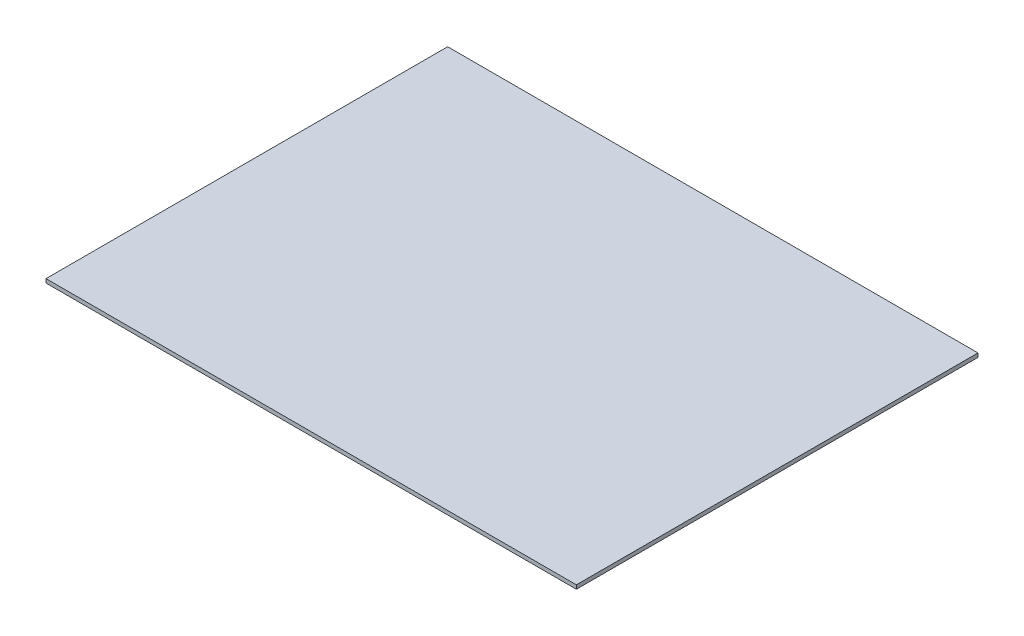
ISO-10303-21;
HEADER;
FILE_DESCRIPTION(('STEP AP214'),'2;1');
FILE_NAME('part.step','',(''),(''),'','','');
FILE_SCHEMA(('AUTOMOTIVE_DESIGN { 1 0 10303 214 1 1 1 1 }'));
ENDSEC;
DATA;
#1=APPLICATION_CONTEXT('core data for automotive mechanical design processes');
#2=APPLICATION_PROTOCOL_DEFINITION('international standard','automotive_design',2000,#1);
#3=PRODUCT_CONTEXT('',#1,'mechanical');
#4=PRODUCT('Part','Part','',(#3));
#5=PRODUCT_RELATED_PRODUCT_CATEGORY('part','',(#4));
#6=PRODUCT_DEFINITION_FORMATION('','',#4);
#7=PRODUCT_DEFINITION_CONTEXT('part definition',#1,'design');
#8=PRODUCT_DEFINITION('design','',#6,#7);
#9=PRODUCT_DEFINITION_SHAPE('','',#8);
#10=(LENGTH_UNIT() NAMED_UNIT(*) SI_UNIT(.MILLI.,.METRE.));
#11=(NAMED_UNIT(*) PLANE_ANGLE_UNIT() SI_UNIT($,.RADIAN.));
#12=(NAMED_UNIT(*) SI_UNIT($,.STERADIAN.) SOLID_ANGLE_UNIT());
#13=UNCERTAINTY_MEASURE_WITH_UNIT(LENGTH_MEASURE(1.E-05),#10,'distance_accuracy_value','');
#14=(GEOMETRIC_REPRESENTATION_CONTEXT(3) GLOBAL_UNCERTAINTY_ASSIGNED_CONTEXT((#13)) GLOBAL_UNIT_ASSIGNED_CONTEXT((#10,
#11,#12)) REPRESENTATION_CONTEXT('',''));
#15=CARTESIAN_POINT('',(0.,0.,0.));
#16=DIRECTION('',(0.,0.,1.));
#17=DIRECTION('',(1.,0.,0.));
#18=AXIS2_PLACEMENT_3D('',#15,#16,#17);
#19=CARTESIAN_POINT('',(-46.0117511781062,3.,-160.757124998766));
#20=DIRECTION('',(0.,0.,1.));
#21=DIRECTION('',(1.,0.,0.));
#22=AXIS2_PLACEMENT_3D('',#19,#20,#21);
#23=PLANE('',#22);
#24=DIRECTION('',(-1.,0.,0.));
#25=VECTOR('',#24,1.);
#26=CARTESIAN_POINT('',(-46.0117511781062,0.,-160.757124998766));
#27=LINE('',#26,#25);
#28=CARTESIAN_POINT('',(365.988248821894,0.,-160.757124998766));
#29=VERTEX_POINT('',#28);
#30=CARTESIAN_POINT('',(-46.0117511781062,0.,-160.757124998766));
#31=VERTEX_POINT('',#30);
#32=EDGE_CURVE('E95',#29,#31,#27,.T.);
#33=ORIENTED_EDGE('',*,*,#32,.T.);
#34=DIRECTION('',(0.,-1.,0.));
#35=VECTOR('',#34,1.);
#36=CARTESIAN_POINT('',(-46.0117511781062,3.,-160.757124998766));
#37=LINE('',#36,#35);
#38=CARTESIAN_POINT('',(-46.0117511781062,3.,-160.757124998766));
#39=VERTEX_POINT('',#38);
#40=EDGE_CURVE('E11',#39,#31,#37,.T.);
#41=ORIENTED_EDGE('',*,*,#40,.F.);
#42=DIRECTION('',(-1.,0.,0.));
#43=VECTOR('',#42,1.);
#44=CARTESIAN_POINT('',(-46.0117511781062,3.,-160.757124998766));
#45=LINE('',#44,#43);
#46=CARTESIAN_POINT('',(365.988248821894,3.,-160.757124998766));
#47=VERTEX_POINT('',#46);
#48=EDGE_CURVE('E83',#47,#39,#45,.T.);
#49=ORIENTED_EDGE('',*,*,#48,.F.);
#50=DIRECTION('',(0.,-1.,0.));
#51=VECTOR('',#50,1.);
#52=CARTESIAN_POINT('',(365.988248821894,3.,-160.757124998766));
#53=LINE('',#52,#51);
#54=EDGE_CURVE('E91',#47,#29,#53,.T.);
#55=ORIENTED_EDGE('',*,*,#54,.T.);
#56=EDGE_LOOP('',(#33,#41,#49,#55));
#57=FACE_BOUND('',#56,.T.);
#58=ADVANCED_FACE('F32',(#57),#23,.F.);
#59=CARTESIAN_POINT('',(-46.0117511781062,3.,-160.757124998766));
#60=DIRECTION('',(1.,0.,0.));
#61=DIRECTION('',(0.,0.,-1.));
#62=AXIS2_PLACEMENT_3D('',#59,#60,#61);
#63=PLANE('',#62);
#64=DIRECTION('',(0.,0.,1.));
#65=VECTOR('',#64,1.);
#66=CARTESIAN_POINT('',(-46.0117511781062,0.,-160.757124998766));
#67=LINE('',#66,#65);
#68=CARTESIAN_POINT('',(-46.0117511781062,0.,151.242875001234));
#69=VERTEX_POINT('',#68);
#70=EDGE_CURVE('E87',#31,#69,#67,.T.);
#71=ORIENTED_EDGE('',*,*,#70,.T.);
#72=DIRECTION('',(0.,-1.,0.));
#73=VECTOR('',#72,1.);
#74=CARTESIAN_POINT('',(-46.0117511781062,3.,151.242875001234));
#75=LINE('',#74,#73);
#76=CARTESIAN_POINT('',(-46.0117511781062,3.,151.242875001234));
#77=VERTEX_POINT('',#76);
#78=EDGE_CURVE('E40',#77,#69,#75,.T.);
#79=ORIENTED_EDGE('',*,*,#78,.F.);
#80=DIRECTION('',(0.,0.,1.));
#81=VECTOR('',#80,1.);
#82=CARTESIAN_POINT('',(-46.0117511781062,3.,-160.757124998766));
#83=LINE('',#82,#81);
#84=EDGE_CURVE('E78',#39,#77,#83,.T.);
#85=ORIENTED_EDGE('',*,*,#84,.F.);
#86=ORIENTED_EDGE('',*,*,#40,.T.);
#87=EDGE_LOOP('',(#71,#79,#85,#86));
#88=FACE_BOUND('',#87,.T.);
#89=ADVANCED_FACE('F86',(#88),#63,.F.);
#90=CARTESIAN_POINT('',(-46.0117511781062,3.,151.242875001234));
#91=DIRECTION('',(0.,0.,-1.));
#92=DIRECTION('',(-1.,0.,0.));
#93=AXIS2_PLACEMENT_3D('',#90,#91,#92);
#94=PLANE('',#93);
#95=DIRECTION('',(1.,0.,0.));
#96=VECTOR('',#95,1.);
#97=CARTESIAN_POINT('',(-46.0117511781062,0.,151.242875001234));
#98=LINE('',#97,#96);
#99=CARTESIAN_POINT('',(365.988248821894,0.,151.242875001235));
#100=VERTEX_POINT('',#99);
#101=EDGE_CURVE('E65',#69,#100,#98,.T.);
#102=ORIENTED_EDGE('',*,*,#101,.T.);
#103=DIRECTION('',(0.,-1.,0.));
#104=VECTOR('',#103,1.);
#105=CARTESIAN_POINT('',(365.988248821894,3.,151.242875001235));
#106=LINE('',#105,#104);
#107=CARTESIAN_POINT('',(365.988248821894,3.,151.242875001235));
#108=VERTEX_POINT('',#107);
#109=EDGE_CURVE('E88',#108,#100,#106,.T.);
#110=ORIENTED_EDGE('',*,*,#109,.F.);
#111=DIRECTION('',(1.,0.,0.));
#112=VECTOR('',#111,1.);
#113=CARTESIAN_POINT('',(-46.0117511781062,3.,151.242875001234));
#114=LINE('',#113,#112);
#115=EDGE_CURVE('E81',#77,#108,#114,.T.);
#116=ORIENTED_EDGE('',*,*,#115,.F.);
#117=ORIENTED_EDGE('',*,*,#78,.T.);
#118=EDGE_LOOP('',(#102,#110,#116,#117));
#119=FACE_BOUND('',#118,.T.);
#120=ADVANCED_FACE('F89',(#119),#94,.F.);
#121=CARTESIAN_POINT('',(365.988248821894,3.,-160.757124998766));
#122=DIRECTION('',(-1.,0.,0.));
#123=DIRECTION('',(0.,0.,1.));
#124=AXIS2_PLACEMENT_3D('',#121,#122,#123);
#125=PLANE('',#124);
#126=DIRECTION('',(0.,0.,-1.));
#127=VECTOR('',#126,1.);
#128=CARTESIAN_POINT('',(365.988248821894,0.,-160.757124998766));
#129=LINE('',#128,#127);
#130=EDGE_CURVE('E71',#100,#29,#129,.T.);
#131=ORIENTED_EDGE('',*,*,#130,.T.);
#132=ORIENTED_EDGE('',*,*,#54,.F.);
#133=DIRECTION('',(0.,0.,-1.));
#134=VECTOR('',#133,1.);
#135=CARTESIAN_POINT('',(365.988248821894,3.,-160.757124998766));
#136=LINE('',#135,#134);
#137=EDGE_CURVE('E48',#108,#47,#136,.T.);
#138=ORIENTED_EDGE('',*,*,#137,.F.);
#139=ORIENTED_EDGE('',*,*,#109,.T.);
#140=EDGE_LOOP('',(#131,#132,#138,#139));
#141=FACE_BOUND('',#140,.T.);
#142=ADVANCED_FACE('F102',(#141),#125,.F.);
#143=CARTESIAN_POINT('',(0.,3.,0.));
#144=DIRECTION('',(0.,-1.,0.));
#145=DIRECTION('',(0.,0.,-1.));
#146=AXIS2_PLACEMENT_3D('',#143,#144,#145);
#147=PLANE('',#146);
#148=ORIENTED_EDGE('',*,*,#48,.T.);
#149=ORIENTED_EDGE('',*,*,#84,.T.);
#150=ORIENTED_EDGE('',*,*,#115,.T.);
#151=ORIENTED_EDGE('',*,*,#137,.T.);
#152=EDGE_LOOP('',(#148,#149,#150,#151));
#153=FACE_BOUND('',#152,.T.);
#154=ADVANCED_FACE('F79',(#153),#147,.F.);
#155=CARTESIAN_POINT('',(0.,0.,0.));
#156=DIRECTION('',(0.,-1.,0.));
#157=DIRECTION('',(0.,0.,-1.));
#158=AXIS2_PLACEMENT_3D('',#155,#156,#157);
#159=PLANE('',#158);
#160=ORIENTED_EDGE('',*,*,#32,.F.);
#161=ORIENTED_EDGE('',*,*,#130,.F.);
#162=ORIENTED_EDGE('',*,*,#101,.F.);
#163=ORIENTED_EDGE('',*,*,#70,.F.);
#164=EDGE_LOOP('',(#160,#161,#162,#163));
#165=FACE_BOUND('',#164,.T.);
#166=ADVANCED_FACE('F105',(#165),#159,.T.);
#167=CLOSED_SHELL('',(#58,#89,#120,#142,#154,#166));
#168=MANIFOLD_SOLID_BREP('B2',#167);
#169=ADVANCED_BREP_SHAPE_REPRESENTATION('',(#18,#168),#14);
#170=SHAPE_DEFINITION_REPRESENTATION(#9,#169);
ENDSEC;
END-ISO-10303-21;
